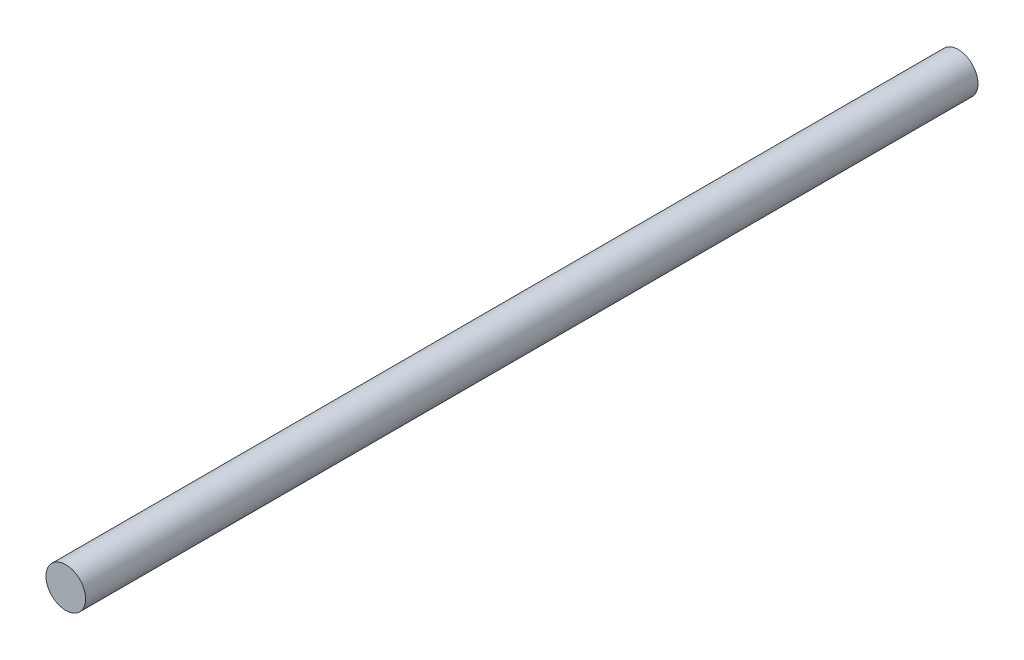
ISO-10303-21;
HEADER;
FILE_DESCRIPTION(('STEP AP214'),'2;1');
FILE_NAME('part.step','',(''),(''),'','','');
FILE_SCHEMA(('AUTOMOTIVE_DESIGN { 1 0 10303 214 1 1 1 1 }'));
ENDSEC;
DATA;
#1=APPLICATION_CONTEXT('core data for automotive mechanical design processes');
#2=APPLICATION_PROTOCOL_DEFINITION('international standard','automotive_design',2000,#1);
#3=PRODUCT_CONTEXT('',#1,'mechanical');
#4=PRODUCT('Part','Part','',(#3));
#5=PRODUCT_RELATED_PRODUCT_CATEGORY('part','',(#4));
#6=PRODUCT_DEFINITION_FORMATION('','',#4);
#7=PRODUCT_DEFINITION_CONTEXT('part definition',#1,'design');
#8=PRODUCT_DEFINITION('design','',#6,#7);
#9=PRODUCT_DEFINITION_SHAPE('','',#8);
#10=(LENGTH_UNIT() NAMED_UNIT(*) SI_UNIT(.MILLI.,.METRE.));
#11=(NAMED_UNIT(*) PLANE_ANGLE_UNIT() SI_UNIT($,.RADIAN.));
#12=(NAMED_UNIT(*) SI_UNIT($,.STERADIAN.) SOLID_ANGLE_UNIT());
#13=UNCERTAINTY_MEASURE_WITH_UNIT(LENGTH_MEASURE(1.E-05),#10,'distance_accuracy_value','');
#14=(GEOMETRIC_REPRESENTATION_CONTEXT(3) GLOBAL_UNCERTAINTY_ASSIGNED_CONTEXT((#13)) GLOBAL_UNIT_ASSIGNED_CONTEXT((#10,
#11,#12)) REPRESENTATION_CONTEXT('',''));
#15=CARTESIAN_POINT('',(0.,0.,0.));
#16=DIRECTION('',(0.,0.,1.));
#17=DIRECTION('',(1.,0.,0.));
#18=AXIS2_PLACEMENT_3D('',#15,#16,#17);
#19=CARTESIAN_POINT('',(0.,0.,142.875));
#20=DIRECTION('',(0.,0.,-1.));
#21=DIRECTION('',(-1.,0.,0.));
#22=AXIS2_PLACEMENT_3D('',#19,#20,#21);
#23=CYLINDRICAL_SURFACE('',#22,3.175);
#24=CARTESIAN_POINT('',(0.,0.,142.875));
#25=DIRECTION('',(0.,0.,1.));
#26=DIRECTION('',(1.,0.,0.));
#27=AXIS2_PLACEMENT_3D('',#24,#25,#26);
#28=CIRCLE('',#27,3.175);
#29=CARTESIAN_POINT('',(3.175,0.,142.875));
#30=VERTEX_POINT('',#29);
#31=EDGE_CURVE('E10',#30,#30,#28,.T.);
#32=ORIENTED_EDGE('',*,*,#31,.F.);
#33=EDGE_LOOP('',(#32));
#34=FACE_BOUND('',#33,.T.);
#35=CARTESIAN_POINT('',(0.,0.,0.));
#36=DIRECTION('',(0.,0.,1.));
#37=DIRECTION('',(1.,0.,0.));
#38=AXIS2_PLACEMENT_3D('',#35,#36,#37);
#39=CIRCLE('',#38,3.175);
#40=CARTESIAN_POINT('',(3.175,0.,0.));
#41=VERTEX_POINT('',#40);
#42=EDGE_CURVE('E34',#41,#41,#39,.T.);
#43=ORIENTED_EDGE('',*,*,#42,.T.);
#44=EDGE_LOOP('',(#43));
#45=FACE_BOUND('',#44,.T.);
#46=ADVANCED_FACE('F31',(#34,#45),#23,.T.);
#47=CARTESIAN_POINT('',(0.,0.,142.875));
#48=DIRECTION('',(0.,0.,1.));
#49=DIRECTION('',(1.,0.,0.));
#50=AXIS2_PLACEMENT_3D('',#47,#48,#49);
#51=PLANE('',#50);
#52=ORIENTED_EDGE('',*,*,#31,.T.);
#53=EDGE_LOOP('',(#52));
#54=FACE_BOUND('',#53,.T.);
#55=ADVANCED_FACE('F46',(#54),#51,.T.);
#56=CARTESIAN_POINT('',(0.,0.,0.));
#57=DIRECTION('',(0.,0.,1.));
#58=DIRECTION('',(1.,0.,0.));
#59=AXIS2_PLACEMENT_3D('',#56,#57,#58);
#60=PLANE('',#59);
#61=ORIENTED_EDGE('',*,*,#42,.F.);
#62=EDGE_LOOP('',(#61));
#63=FACE_BOUND('',#62,.T.);
#64=ADVANCED_FACE('F44',(#63),#60,.F.);
#65=CLOSED_SHELL('',(#46,#55,#64));
#66=MANIFOLD_SOLID_BREP('B2',#65);
#67=ADVANCED_BREP_SHAPE_REPRESENTATION('',(#18,#66),#14);
#68=SHAPE_DEFINITION_REPRESENTATION(#9,#67);
ENDSEC;
END-ISO-10303-21;
